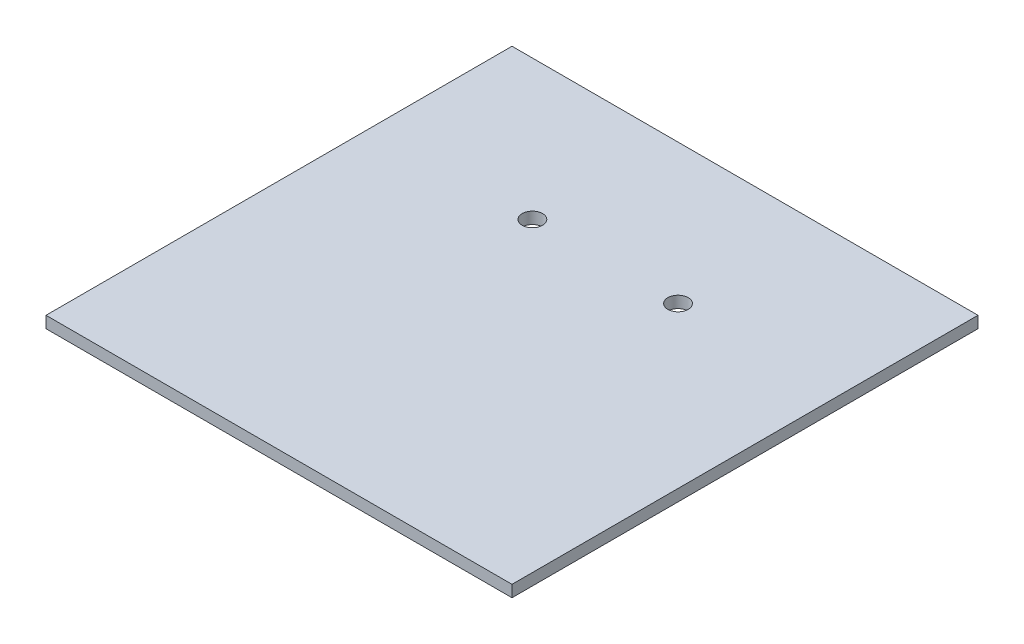
ISO-10303-21;
HEADER;
FILE_DESCRIPTION(('STEP AP214'),'2;1');
FILE_NAME('part.step','',(''),(''),'','','');
FILE_SCHEMA(('AUTOMOTIVE_DESIGN { 1 0 10303 214 1 1 1 1 }'));
ENDSEC;
DATA;
#1=APPLICATION_CONTEXT('core data for automotive mechanical design processes');
#2=APPLICATION_PROTOCOL_DEFINITION('international standard','automotive_design',2000,#1);
#3=PRODUCT_CONTEXT('',#1,'mechanical');
#4=PRODUCT('Part','Part','',(#3));
#5=PRODUCT_RELATED_PRODUCT_CATEGORY('part','',(#4));
#6=PRODUCT_DEFINITION_FORMATION('','',#4);
#7=PRODUCT_DEFINITION_CONTEXT('part definition',#1,'design');
#8=PRODUCT_DEFINITION('design','',#6,#7);
#9=PRODUCT_DEFINITION_SHAPE('','',#8);
#10=(LENGTH_UNIT() NAMED_UNIT(*) SI_UNIT(.MILLI.,.METRE.));
#11=(NAMED_UNIT(*) PLANE_ANGLE_UNIT() SI_UNIT($,.RADIAN.));
#12=(NAMED_UNIT(*) SI_UNIT($,.STERADIAN.) SOLID_ANGLE_UNIT());
#13=UNCERTAINTY_MEASURE_WITH_UNIT(LENGTH_MEASURE(1.E-05),#10,'distance_accuracy_value','');
#14=(GEOMETRIC_REPRESENTATION_CONTEXT(3) GLOBAL_UNCERTAINTY_ASSIGNED_CONTEXT((#13)) GLOBAL_UNIT_ASSIGNED_CONTEXT((#10,
#11,#12)) REPRESENTATION_CONTEXT('',''));
#15=CARTESIAN_POINT('',(0.,0.,0.));
#16=DIRECTION('',(0.,0.,1.));
#17=DIRECTION('',(1.,0.,0.));
#18=AXIS2_PLACEMENT_3D('',#15,#16,#17);
#19=CARTESIAN_POINT('',(0.,2.,0.));
#20=DIRECTION('',(1.,0.,0.));
#21=DIRECTION('',(0.,0.,-1.));
#22=AXIS2_PLACEMENT_3D('',#19,#20,#21);
#23=PLANE('',#22);
#24=DIRECTION('',(0.,0.,1.));
#25=VECTOR('',#24,1.);
#26=CARTESIAN_POINT('',(0.,0.,0.));
#27=LINE('',#26,#25);
#28=CARTESIAN_POINT('',(0.,0.,-80.));
#29=VERTEX_POINT('',#28);
#30=CARTESIAN_POINT('',(0.,0.,0.));
#31=VERTEX_POINT('',#30);
#32=EDGE_CURVE('E96',#29,#31,#27,.T.);
#33=ORIENTED_EDGE('',*,*,#32,.T.);
#34=DIRECTION('',(0.,-1.,0.));
#35=VECTOR('',#34,1.);
#36=CARTESIAN_POINT('',(0.,2.,0.));
#37=LINE('',#36,#35);
#38=CARTESIAN_POINT('',(0.,2.,0.));
#39=VERTEX_POINT('',#38);
#40=EDGE_CURVE('E11',#39,#31,#37,.T.);
#41=ORIENTED_EDGE('',*,*,#40,.F.);
#42=DIRECTION('',(0.,0.,1.));
#43=VECTOR('',#42,1.);
#44=CARTESIAN_POINT('',(0.,2.,0.));
#45=LINE('',#44,#43);
#46=CARTESIAN_POINT('',(0.,2.,-80.));
#47=VERTEX_POINT('',#46);
#48=EDGE_CURVE('E84',#47,#39,#45,.T.);
#49=ORIENTED_EDGE('',*,*,#48,.F.);
#50=DIRECTION('',(0.,-1.,0.));
#51=VECTOR('',#50,1.);
#52=CARTESIAN_POINT('',(0.,2.,-80.));
#53=LINE('',#52,#51);
#54=EDGE_CURVE('E92',#47,#29,#53,.T.);
#55=ORIENTED_EDGE('',*,*,#54,.T.);
#56=EDGE_LOOP('',(#33,#41,#49,#55));
#57=FACE_BOUND('',#56,.T.);
#58=ADVANCED_FACE('F33',(#57),#23,.F.);
#59=CARTESIAN_POINT('',(0.,2.,0.));
#60=DIRECTION('',(0.,0.,-1.));
#61=DIRECTION('',(-1.,0.,0.));
#62=AXIS2_PLACEMENT_3D('',#59,#60,#61);
#63=PLANE('',#62);
#64=DIRECTION('',(1.,0.,0.));
#65=VECTOR('',#64,1.);
#66=CARTESIAN_POINT('',(0.,0.,0.));
#67=LINE('',#66,#65);
#68=CARTESIAN_POINT('',(80.,0.,0.));
#69=VERTEX_POINT('',#68);
#70=EDGE_CURVE('E88',#31,#69,#67,.T.);
#71=ORIENTED_EDGE('',*,*,#70,.T.);
#72=DIRECTION('',(0.,-1.,0.));
#73=VECTOR('',#72,1.);
#74=CARTESIAN_POINT('',(80.,2.,0.));
#75=LINE('',#74,#73);
#76=CARTESIAN_POINT('',(80.,2.,0.));
#77=VERTEX_POINT('',#76);
#78=EDGE_CURVE('E41',#77,#69,#75,.T.);
#79=ORIENTED_EDGE('',*,*,#78,.F.);
#80=DIRECTION('',(1.,0.,0.));
#81=VECTOR('',#80,1.);
#82=CARTESIAN_POINT('',(0.,2.,0.));
#83=LINE('',#82,#81);
#84=EDGE_CURVE('E79',#39,#77,#83,.T.);
#85=ORIENTED_EDGE('',*,*,#84,.F.);
#86=ORIENTED_EDGE('',*,*,#40,.T.);
#87=EDGE_LOOP('',(#71,#79,#85,#86));
#88=FACE_BOUND('',#87,.T.);
#89=ADVANCED_FACE('F87',(#88),#63,.F.);
#90=CARTESIAN_POINT('',(80.,2.,0.));
#91=DIRECTION('',(-1.,0.,0.));
#92=DIRECTION('',(0.,0.,1.));
#93=AXIS2_PLACEMENT_3D('',#90,#91,#92);
#94=PLANE('',#93);
#95=DIRECTION('',(0.,0.,-1.));
#96=VECTOR('',#95,1.);
#97=CARTESIAN_POINT('',(80.,0.,0.));
#98=LINE('',#97,#96);
#99=CARTESIAN_POINT('',(80.,0.,-80.));
#100=VERTEX_POINT('',#99);
#101=EDGE_CURVE('E66',#69,#100,#98,.T.);
#102=ORIENTED_EDGE('',*,*,#101,.T.);
#103=DIRECTION('',(0.,-1.,0.));
#104=VECTOR('',#103,1.);
#105=CARTESIAN_POINT('',(80.,2.,-80.));
#106=LINE('',#105,#104);
#107=CARTESIAN_POINT('',(80.,2.,-80.));
#108=VERTEX_POINT('',#107);
#109=EDGE_CURVE('E89',#108,#100,#106,.T.);
#110=ORIENTED_EDGE('',*,*,#109,.F.);
#111=DIRECTION('',(0.,0.,-1.));
#112=VECTOR('',#111,1.);
#113=CARTESIAN_POINT('',(80.,2.,0.));
#114=LINE('',#113,#112);
#115=EDGE_CURVE('E82',#77,#108,#114,.T.);
#116=ORIENTED_EDGE('',*,*,#115,.F.);
#117=ORIENTED_EDGE('',*,*,#78,.T.);
#118=EDGE_LOOP('',(#102,#110,#116,#117));
#119=FACE_BOUND('',#118,.T.);
#120=ADVANCED_FACE('F90',(#119),#94,.F.);
#121=CARTESIAN_POINT('',(0.,2.,-80.));
#122=DIRECTION('',(0.,0.,1.));
#123=DIRECTION('',(1.,0.,0.));
#124=AXIS2_PLACEMENT_3D('',#121,#122,#123);
#125=PLANE('',#124);
#126=DIRECTION('',(-1.,0.,0.));
#127=VECTOR('',#126,1.);
#128=CARTESIAN_POINT('',(0.,0.,-80.));
#129=LINE('',#128,#127);
#130=EDGE_CURVE('E72',#100,#29,#129,.T.);
#131=ORIENTED_EDGE('',*,*,#130,.T.);
#132=ORIENTED_EDGE('',*,*,#54,.F.);
#133=DIRECTION('',(-1.,0.,0.));
#134=VECTOR('',#133,1.);
#135=CARTESIAN_POINT('',(0.,2.,-80.));
#136=LINE('',#135,#134);
#137=EDGE_CURVE('E49',#108,#47,#136,.T.);
#138=ORIENTED_EDGE('',*,*,#137,.F.);
#139=ORIENTED_EDGE('',*,*,#109,.T.);
#140=EDGE_LOOP('',(#131,#132,#138,#139));
#141=FACE_BOUND('',#140,.T.);
#142=ADVANCED_FACE('F104',(#141),#125,.F.);
#143=CARTESIAN_POINT('',(0.,2.,0.));
#144=DIRECTION('',(0.,-1.,0.));
#145=DIRECTION('',(0.,0.,-1.));
#146=AXIS2_PLACEMENT_3D('',#143,#144,#145);
#147=PLANE('',#146);
#148=CARTESIAN_POINT('',(52.5,2.,-56.));
#149=DIRECTION('',(0.,1.,0.));
#150=DIRECTION('',(0.,0.,-1.));
#151=AXIS2_PLACEMENT_3D('',#148,#149,#150);
#152=CIRCLE('',#151,1.75);
#153=CARTESIAN_POINT('',(52.5,2.,-57.75));
#154=VERTEX_POINT('',#153);
#155=EDGE_CURVE('E113',#154,#154,#152,.T.);
#156=ORIENTED_EDGE('',*,*,#155,.F.);
#157=EDGE_LOOP('',(#156));
#158=FACE_BOUND('',#157,.T.);
#159=CARTESIAN_POINT('',(27.5,2.,-56.));
#160=DIRECTION('',(0.,1.,0.));
#161=DIRECTION('',(0.,0.,1.));
#162=AXIS2_PLACEMENT_3D('',#159,#160,#161);
#163=CIRCLE('',#162,1.75);
#164=CARTESIAN_POINT('',(27.5,2.,-54.25));
#165=VERTEX_POINT('',#164);
#166=EDGE_CURVE('E99',#165,#165,#163,.T.);
#167=ORIENTED_EDGE('',*,*,#166,.F.);
#168=EDGE_LOOP('',(#167));
#169=FACE_BOUND('',#168,.T.);
#170=ORIENTED_EDGE('',*,*,#48,.T.);
#171=ORIENTED_EDGE('',*,*,#84,.T.);
#172=ORIENTED_EDGE('',*,*,#115,.T.);
#173=ORIENTED_EDGE('',*,*,#137,.T.);
#174=EDGE_LOOP('',(#170,#171,#172,#173));
#175=FACE_BOUND('',#174,.T.);
#176=ADVANCED_FACE('F80',(#158,#169,#175),#147,.F.);
#177=CARTESIAN_POINT('',(0.,0.,0.));
#178=DIRECTION('',(0.,-1.,0.));
#179=DIRECTION('',(0.,0.,-1.));
#180=AXIS2_PLACEMENT_3D('',#177,#178,#179);
#181=PLANE('',#180);
#182=CARTESIAN_POINT('',(52.5,0.,-56.));
#183=DIRECTION('',(0.,-1.,0.));
#184=DIRECTION('',(0.,0.,-1.));
#185=AXIS2_PLACEMENT_3D('',#182,#183,#184);
#186=CIRCLE('',#185,1.75);
#187=CARTESIAN_POINT('',(52.5,0.,-57.75));
#188=VERTEX_POINT('',#187);
#189=EDGE_CURVE('E116',#188,#188,#186,.F.);
#190=ORIENTED_EDGE('',*,*,#189,.T.);
#191=EDGE_LOOP('',(#190));
#192=FACE_BOUND('',#191,.T.);
#193=CARTESIAN_POINT('',(27.5,0.,-56.));
#194=DIRECTION('',(0.,-1.,0.));
#195=DIRECTION('',(0.,0.,-1.));
#196=AXIS2_PLACEMENT_3D('',#193,#194,#195);
#197=CIRCLE('',#196,1.75);
#198=CARTESIAN_POINT('',(27.5,0.,-57.75));
#199=VERTEX_POINT('',#198);
#200=EDGE_CURVE('E110',#199,#199,#197,.F.);
#201=ORIENTED_EDGE('',*,*,#200,.T.);
#202=EDGE_LOOP('',(#201));
#203=FACE_BOUND('',#202,.T.);
#204=ORIENTED_EDGE('',*,*,#32,.F.);
#205=ORIENTED_EDGE('',*,*,#130,.F.);
#206=ORIENTED_EDGE('',*,*,#101,.F.);
#207=ORIENTED_EDGE('',*,*,#70,.F.);
#208=EDGE_LOOP('',(#204,#205,#206,#207));
#209=FACE_BOUND('',#208,.T.);
#210=ADVANCED_FACE('F107',(#192,#203,#209),#181,.T.);
#211=CARTESIAN_POINT('',(27.5,-0.00100000000000013,-56.));
#212=DIRECTION('',(0.,1.,0.));
#213=DIRECTION('',(0.,0.,1.));
#214=AXIS2_PLACEMENT_3D('',#211,#212,#213);
#215=CYLINDRICAL_SURFACE('',#214,1.75);
#216=ORIENTED_EDGE('',*,*,#200,.F.);
#217=EDGE_LOOP('',(#216));
#218=FACE_BOUND('',#217,.T.);
#219=ORIENTED_EDGE('',*,*,#166,.T.);
#220=EDGE_LOOP('',(#219));
#221=FACE_BOUND('',#220,.T.);
#222=ADVANCED_FACE('F129',(#218,#221),#215,.F.);
#223=CARTESIAN_POINT('',(52.5,-0.00100000000000013,-56.));
#224=DIRECTION('',(0.,1.,0.));
#225=DIRECTION('',(0.,0.,1.));
#226=AXIS2_PLACEMENT_3D('',#223,#224,#225);
#227=CYLINDRICAL_SURFACE('',#226,1.75);
#228=ORIENTED_EDGE('',*,*,#189,.F.);
#229=EDGE_LOOP('',(#228));
#230=FACE_BOUND('',#229,.T.);
#231=ORIENTED_EDGE('',*,*,#155,.T.);
#232=EDGE_LOOP('',(#231));
#233=FACE_BOUND('',#232,.T.);
#234=ADVANCED_FACE('F122',(#230,#233),#227,.F.);
#235=CLOSED_SHELL('',(#58,#89,#120,#142,#176,#210,#222,#234));
#236=MANIFOLD_SOLID_BREP('B2',#235);
#237=ADVANCED_BREP_SHAPE_REPRESENTATION('',(#18,#236),#14);
#238=SHAPE_DEFINITION_REPRESENTATION(#9,#237);
ENDSEC;
END-ISO-10303-21;
